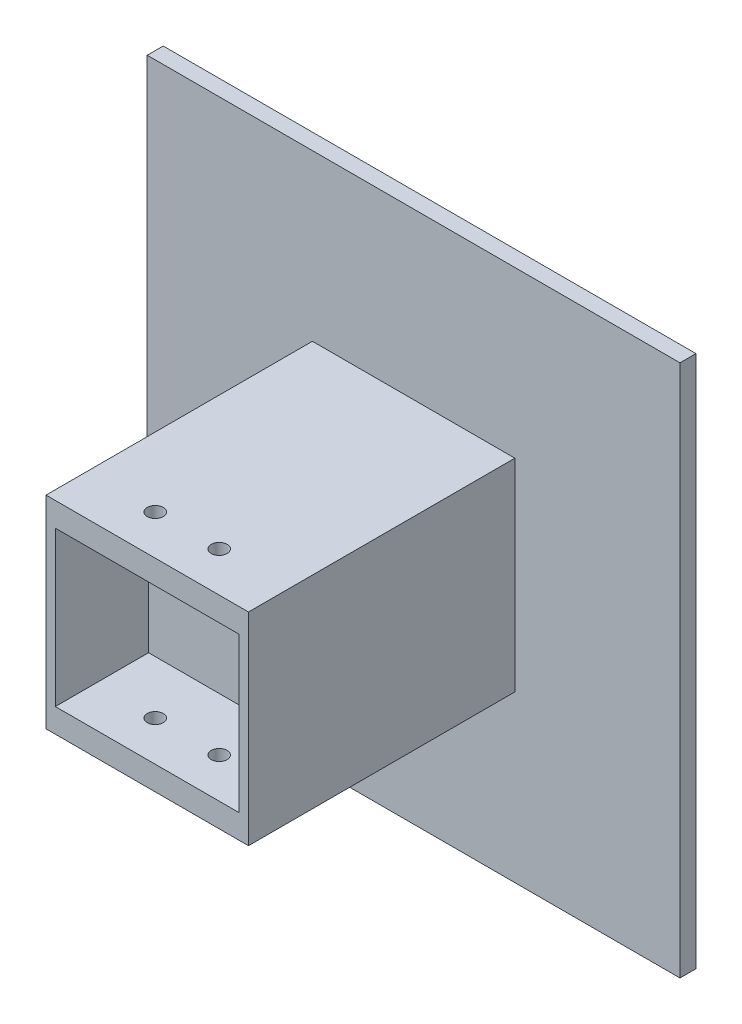
ISO-10303-21;
HEADER;
FILE_DESCRIPTION(('STEP AP214'),'2;1');
FILE_NAME('part.step','',(''),(''),'','','');
FILE_SCHEMA(('AUTOMOTIVE_DESIGN { 1 0 10303 214 1 1 1 1 }'));
ENDSEC;
DATA;
#1=APPLICATION_CONTEXT('core data for automotive mechanical design processes');
#2=APPLICATION_PROTOCOL_DEFINITION('international standard','automotive_design',2000,#1);
#3=PRODUCT_CONTEXT('',#1,'mechanical');
#4=PRODUCT('Part','Part','',(#3));
#5=PRODUCT_RELATED_PRODUCT_CATEGORY('part','',(#4));
#6=PRODUCT_DEFINITION_FORMATION('','',#4);
#7=PRODUCT_DEFINITION_CONTEXT('part definition',#1,'design');
#8=PRODUCT_DEFINITION('design','',#6,#7);
#9=PRODUCT_DEFINITION_SHAPE('','',#8);
#10=(LENGTH_UNIT() NAMED_UNIT(*) SI_UNIT(.MILLI.,.METRE.));
#11=(NAMED_UNIT(*) PLANE_ANGLE_UNIT() SI_UNIT($,.RADIAN.));
#12=(NAMED_UNIT(*) SI_UNIT($,.STERADIAN.) SOLID_ANGLE_UNIT());
#13=UNCERTAINTY_MEASURE_WITH_UNIT(LENGTH_MEASURE(1.E-05),#10,'distance_accuracy_value','');
#14=(GEOMETRIC_REPRESENTATION_CONTEXT(3) GLOBAL_UNCERTAINTY_ASSIGNED_CONTEXT((#13)) GLOBAL_UNIT_ASSIGNED_CONTEXT((#10,
#11,#12)) REPRESENTATION_CONTEXT('',''));
#15=CARTESIAN_POINT('',(0.,0.,0.));
#16=DIRECTION('',(0.,0.,1.));
#17=DIRECTION('',(1.,0.,0.));
#18=AXIS2_PLACEMENT_3D('',#15,#16,#17);
#19=CARTESIAN_POINT('',(-19.,19.,53.));
#20=DIRECTION('',(0.,-1.,0.));
#21=DIRECTION('',(0.,0.,-1.));
#22=AXIS2_PLACEMENT_3D('',#19,#20,#21);
#23=PLANE('',#22);
#24=CARTESIAN_POINT('',(6.,19.,45.5));
#25=DIRECTION('',(0.,1.,0.));
#26=DIRECTION('',(0.,0.,1.));
#27=AXIS2_PLACEMENT_3D('',#24,#25,#26);
#28=CIRCLE('',#27,1.5);
#29=CARTESIAN_POINT('',(6.,19.,47.));
#30=VERTEX_POINT('',#29);
#31=EDGE_CURVE('E234',#30,#30,#28,.T.);
#32=ORIENTED_EDGE('',*,*,#31,.F.);
#33=EDGE_LOOP('',(#32));
#34=FACE_BOUND('',#33,.T.);
#35=DIRECTION('',(-1.,0.,0.));
#36=VECTOR('',#35,1.);
#37=CARTESIAN_POINT('',(-19.,19.,3.));
#38=LINE('',#37,#36);
#39=CARTESIAN_POINT('',(19.,19.,3.));
#40=VERTEX_POINT('',#39);
#41=CARTESIAN_POINT('',(-19.,19.,3.));
#42=VERTEX_POINT('',#41);
#43=EDGE_CURVE('E181',#40,#42,#38,.T.);
#44=ORIENTED_EDGE('',*,*,#43,.T.);
#45=DIRECTION('',(0.,0.,-1.));
#46=VECTOR('',#45,1.);
#47=CARTESIAN_POINT('',(-19.,19.,53.));
#48=LINE('',#47,#46);
#49=CARTESIAN_POINT('',(-19.,19.,53.));
#50=VERTEX_POINT('',#49);
#51=EDGE_CURVE('E193',#50,#42,#48,.T.);
#52=ORIENTED_EDGE('',*,*,#51,.F.);
#53=DIRECTION('',(-1.,0.,0.));
#54=VECTOR('',#53,1.);
#55=CARTESIAN_POINT('',(-19.,19.,53.));
#56=LINE('',#55,#54);
#57=CARTESIAN_POINT('',(19.,19.,53.));
#58=VERTEX_POINT('',#57);
#59=EDGE_CURVE('E172',#58,#50,#56,.T.);
#60=ORIENTED_EDGE('',*,*,#59,.F.);
#61=DIRECTION('',(0.,0.,-1.));
#62=VECTOR('',#61,1.);
#63=CARTESIAN_POINT('',(19.,19.,53.));
#64=LINE('',#63,#62);
#65=EDGE_CURVE('E196',#58,#40,#64,.T.);
#66=ORIENTED_EDGE('',*,*,#65,.T.);
#67=EDGE_LOOP('',(#44,#52,#60,#66));
#68=FACE_BOUND('',#67,.T.);
#69=CARTESIAN_POINT('',(-6.,19.,45.5));
#70=DIRECTION('',(0.,-1.,0.));
#71=DIRECTION('',(0.,0.,-1.));
#72=AXIS2_PLACEMENT_3D('',#69,#70,#71);
#73=CIRCLE('',#72,1.5);
#74=CARTESIAN_POINT('',(-6.,19.,44.));
#75=VERTEX_POINT('',#74);
#76=EDGE_CURVE('E227',#75,#75,#73,.T.);
#77=ORIENTED_EDGE('',*,*,#76,.T.);
#78=EDGE_LOOP('',(#77));
#79=FACE_BOUND('',#78,.T.);
#80=ADVANCED_FACE('F36',(#34,#68,#79),#23,.F.);
#81=CARTESIAN_POINT('',(-19.,-19.,53.));
#82=DIRECTION('',(0.,1.,0.));
#83=DIRECTION('',(0.,0.,1.));
#84=AXIS2_PLACEMENT_3D('',#81,#82,#83);
#85=PLANE('',#84);
#86=CARTESIAN_POINT('',(6.,-19.,45.5));
#87=DIRECTION('',(0.,1.,0.));
#88=DIRECTION('',(0.,0.,1.));
#89=AXIS2_PLACEMENT_3D('',#86,#87,#88);
#90=CIRCLE('',#89,1.5);
#91=CARTESIAN_POINT('',(6.,-19.,47.));
#92=VERTEX_POINT('',#91);
#93=EDGE_CURVE('E231',#92,#92,#90,.T.);
#94=ORIENTED_EDGE('',*,*,#93,.T.);
#95=EDGE_LOOP('',(#94));
#96=FACE_BOUND('',#95,.T.);
#97=DIRECTION('',(1.,0.,0.));
#98=VECTOR('',#97,1.);
#99=CARTESIAN_POINT('',(-19.,-19.,3.));
#100=LINE('',#99,#98);
#101=CARTESIAN_POINT('',(-19.,-19.,3.));
#102=VERTEX_POINT('',#101);
#103=CARTESIAN_POINT('',(19.,-19.,3.));
#104=VERTEX_POINT('',#103);
#105=EDGE_CURVE('E173',#102,#104,#100,.T.);
#106=ORIENTED_EDGE('',*,*,#105,.T.);
#107=DIRECTION('',(0.,0.,-1.));
#108=VECTOR('',#107,1.);
#109=CARTESIAN_POINT('',(19.,-19.,53.));
#110=LINE('',#109,#108);
#111=CARTESIAN_POINT('',(19.,-19.,53.));
#112=VERTEX_POINT('',#111);
#113=EDGE_CURVE('E179',#112,#104,#110,.T.);
#114=ORIENTED_EDGE('',*,*,#113,.F.);
#115=DIRECTION('',(1.,0.,0.));
#116=VECTOR('',#115,1.);
#117=CARTESIAN_POINT('',(-19.,-19.,53.));
#118=LINE('',#117,#116);
#119=CARTESIAN_POINT('',(-19.,-19.,53.));
#120=VERTEX_POINT('',#119);
#121=EDGE_CURVE('E177',#120,#112,#118,.T.);
#122=ORIENTED_EDGE('',*,*,#121,.F.);
#123=DIRECTION('',(0.,0.,-1.));
#124=VECTOR('',#123,1.);
#125=CARTESIAN_POINT('',(-19.,-19.,53.));
#126=LINE('',#125,#124);
#127=EDGE_CURVE('E190',#120,#102,#126,.T.);
#128=ORIENTED_EDGE('',*,*,#127,.T.);
#129=EDGE_LOOP('',(#106,#114,#122,#128));
#130=FACE_BOUND('',#129,.T.);
#131=CARTESIAN_POINT('',(-6.,-19.,45.5));
#132=DIRECTION('',(0.,1.,0.));
#133=DIRECTION('',(0.,0.,1.));
#134=AXIS2_PLACEMENT_3D('',#131,#132,#133);
#135=CIRCLE('',#134,1.5);
#136=CARTESIAN_POINT('',(-6.,-19.,47.));
#137=VERTEX_POINT('',#136);
#138=EDGE_CURVE('E154',#137,#137,#135,.F.);
#139=ORIENTED_EDGE('',*,*,#138,.F.);
#140=EDGE_LOOP('',(#139));
#141=FACE_BOUND('',#140,.T.);
#142=ADVANCED_FACE('F260',(#96,#130,#141),#85,.F.);
#143=CARTESIAN_POINT('',(-17.25,-14.5,35.5));
#144=DIRECTION('',(0.,-1.,0.));
#145=DIRECTION('',(0.,0.,-1.));
#146=AXIS2_PLACEMENT_3D('',#143,#144,#145);
#147=PLANE('',#146);
#148=CARTESIAN_POINT('',(6.,-14.5,45.5));
#149=DIRECTION('',(0.,-1.,0.));
#150=DIRECTION('',(0.,0.,-1.));
#151=AXIS2_PLACEMENT_3D('',#148,#149,#150);
#152=CIRCLE('',#151,1.5);
#153=CARTESIAN_POINT('',(6.,-14.5,44.));
#154=VERTEX_POINT('',#153);
#155=EDGE_CURVE('E226',#154,#154,#152,.T.);
#156=ORIENTED_EDGE('',*,*,#155,.T.);
#157=EDGE_LOOP('',(#156));
#158=FACE_BOUND('',#157,.T.);
#159=DIRECTION('',(1.,0.,0.));
#160=VECTOR('',#159,1.);
#161=CARTESIAN_POINT('',(-17.25,-14.5,53.));
#162=LINE('',#161,#160);
#163=CARTESIAN_POINT('',(-17.25,-14.5,53.));
#164=VERTEX_POINT('',#163);
#165=CARTESIAN_POINT('',(17.25,-14.5,53.));
#166=VERTEX_POINT('',#165);
#167=EDGE_CURVE('E148',#164,#166,#162,.T.);
#168=ORIENTED_EDGE('',*,*,#167,.T.);
#169=DIRECTION('',(0.,0.,1.));
#170=VECTOR('',#169,1.);
#171=CARTESIAN_POINT('',(17.25,-14.5,35.5));
#172=LINE('',#171,#170);
#173=CARTESIAN_POINT('',(17.25,-14.5,35.5));
#174=VERTEX_POINT('',#173);
#175=EDGE_CURVE('E164',#174,#166,#172,.T.);
#176=ORIENTED_EDGE('',*,*,#175,.F.);
#177=DIRECTION('',(1.,0.,0.));
#178=VECTOR('',#177,1.);
#179=CARTESIAN_POINT('',(-17.25,-14.5,35.5));
#180=LINE('',#179,#178);
#181=CARTESIAN_POINT('',(-17.25,-14.5,35.5));
#182=VERTEX_POINT('',#181);
#183=EDGE_CURVE('E135',#182,#174,#180,.T.);
#184=ORIENTED_EDGE('',*,*,#183,.F.);
#185=DIRECTION('',(0.,0.,1.));
#186=VECTOR('',#185,1.);
#187=CARTESIAN_POINT('',(-17.25,-14.5,35.5));
#188=LINE('',#187,#186);
#189=EDGE_CURVE('E166',#182,#164,#188,.T.);
#190=ORIENTED_EDGE('',*,*,#189,.T.);
#191=EDGE_LOOP('',(#168,#176,#184,#190));
#192=FACE_BOUND('',#191,.T.);
#193=CARTESIAN_POINT('',(-6.,-14.5,45.5));
#194=DIRECTION('',(0.,-1.,0.));
#195=DIRECTION('',(0.,0.,-1.));
#196=AXIS2_PLACEMENT_3D('',#193,#194,#195);
#197=CIRCLE('',#196,1.5);
#198=CARTESIAN_POINT('',(-6.,-14.5,44.));
#199=VERTEX_POINT('',#198);
#200=EDGE_CURVE('E242',#199,#199,#197,.F.);
#201=ORIENTED_EDGE('',*,*,#200,.F.);
#202=EDGE_LOOP('',(#201));
#203=FACE_BOUND('',#202,.T.);
#204=ADVANCED_FACE('F252',(#158,#192,#203),#147,.F.);
#205=CARTESIAN_POINT('',(-17.25,14.5,35.5));
#206=DIRECTION('',(0.,1.,0.));
#207=DIRECTION('',(0.,0.,1.));
#208=AXIS2_PLACEMENT_3D('',#205,#206,#207);
#209=PLANE('',#208);
#210=CARTESIAN_POINT('',(6.,14.5,45.5));
#211=DIRECTION('',(0.,1.,0.));
#212=DIRECTION('',(0.,0.,1.));
#213=AXIS2_PLACEMENT_3D('',#210,#211,#212);
#214=CIRCLE('',#213,1.5);
#215=CARTESIAN_POINT('',(6.,14.5,47.));
#216=VERTEX_POINT('',#215);
#217=EDGE_CURVE('E224',#216,#216,#214,.T.);
#218=ORIENTED_EDGE('',*,*,#217,.T.);
#219=EDGE_LOOP('',(#218));
#220=FACE_BOUND('',#219,.T.);
#221=DIRECTION('',(-1.,0.,0.));
#222=VECTOR('',#221,1.);
#223=CARTESIAN_POINT('',(-17.25,14.5,53.));
#224=LINE('',#223,#222);
#225=CARTESIAN_POINT('',(17.25,14.5,53.));
#226=VERTEX_POINT('',#225);
#227=CARTESIAN_POINT('',(-17.25,14.5,53.));
#228=VERTEX_POINT('',#227);
#229=EDGE_CURVE('E160',#226,#228,#224,.T.);
#230=ORIENTED_EDGE('',*,*,#229,.T.);
#231=DIRECTION('',(0.,0.,1.));
#232=VECTOR('',#231,1.);
#233=CARTESIAN_POINT('',(-17.25,14.5,35.5));
#234=LINE('',#233,#232);
#235=CARTESIAN_POINT('',(-17.25,14.5,35.5));
#236=VERTEX_POINT('',#235);
#237=EDGE_CURVE('E134',#236,#228,#234,.T.);
#238=ORIENTED_EDGE('',*,*,#237,.F.);
#239=DIRECTION('',(-1.,0.,0.));
#240=VECTOR('',#239,1.);
#241=CARTESIAN_POINT('',(-17.25,14.5,35.5));
#242=LINE('',#241,#240);
#243=CARTESIAN_POINT('',(17.25,14.5,35.5));
#244=VERTEX_POINT('',#243);
#245=EDGE_CURVE('E138',#244,#236,#242,.T.);
#246=ORIENTED_EDGE('',*,*,#245,.F.);
#247=DIRECTION('',(0.,0.,1.));
#248=VECTOR('',#247,1.);
#249=CARTESIAN_POINT('',(17.25,14.5,35.5));
#250=LINE('',#249,#248);
#251=EDGE_CURVE('E125',#244,#226,#250,.T.);
#252=ORIENTED_EDGE('',*,*,#251,.T.);
#253=EDGE_LOOP('',(#230,#238,#246,#252));
#254=FACE_BOUND('',#253,.T.);
#255=CARTESIAN_POINT('',(-6.,14.5,45.5));
#256=DIRECTION('',(0.,1.,0.));
#257=DIRECTION('',(0.,0.,1.));
#258=AXIS2_PLACEMENT_3D('',#255,#256,#257);
#259=CIRCLE('',#258,1.5);
#260=CARTESIAN_POINT('',(-6.,14.5,47.));
#261=VERTEX_POINT('',#260);
#262=EDGE_CURVE('E40',#261,#261,#259,.F.);
#263=ORIENTED_EDGE('',*,*,#262,.F.);
#264=EDGE_LOOP('',(#263));
#265=FACE_BOUND('',#264,.T.);
#266=ADVANCED_FACE('F139',(#220,#254,#265),#209,.F.);
#267=CARTESIAN_POINT('',(50.,50.,3.));
#268=DIRECTION('',(-1.,0.,0.));
#269=DIRECTION('',(0.,0.,1.));
#270=AXIS2_PLACEMENT_3D('',#267,#268,#269);
#271=PLANE('',#270);
#272=DIRECTION('',(0.,1.,0.));
#273=VECTOR('',#272,1.);
#274=CARTESIAN_POINT('',(50.,50.,0.));
#275=LINE('',#274,#273);
#276=CARTESIAN_POINT('',(50.,-50.,0.));
#277=VERTEX_POINT('',#276);
#278=CARTESIAN_POINT('',(50.,50.,0.));
#279=VERTEX_POINT('',#278);
#280=EDGE_CURVE('E199',#277,#279,#275,.T.);
#281=ORIENTED_EDGE('',*,*,#280,.T.);
#282=DIRECTION('',(0.,0.,-1.));
#283=VECTOR('',#282,1.);
#284=CARTESIAN_POINT('',(50.,50.,3.));
#285=LINE('',#284,#283);
#286=CARTESIAN_POINT('',(50.,50.,3.));
#287=VERTEX_POINT('',#286);
#288=EDGE_CURVE('E11',#287,#279,#285,.T.);
#289=ORIENTED_EDGE('',*,*,#288,.F.);
#290=DIRECTION('',(0.,1.,0.));
#291=VECTOR('',#290,1.);
#292=CARTESIAN_POINT('',(50.,50.,3.));
#293=LINE('',#292,#291);
#294=CARTESIAN_POINT('',(50.,-50.,3.));
#295=VERTEX_POINT('',#294);
#296=EDGE_CURVE('E200',#295,#287,#293,.T.);
#297=ORIENTED_EDGE('',*,*,#296,.F.);
#298=DIRECTION('',(0.,0.,-1.));
#299=VECTOR('',#298,1.);
#300=CARTESIAN_POINT('',(50.,-50.,3.));
#301=LINE('',#300,#299);
#302=EDGE_CURVE('E210',#295,#277,#301,.T.);
#303=ORIENTED_EDGE('',*,*,#302,.T.);
#304=EDGE_LOOP('',(#281,#289,#297,#303));
#305=FACE_BOUND('',#304,.T.);
#306=ADVANCED_FACE('F38',(#305),#271,.F.);
#307=CARTESIAN_POINT('',(-50.,50.,3.));
#308=DIRECTION('',(0.,-1.,0.));
#309=DIRECTION('',(0.,0.,-1.));
#310=AXIS2_PLACEMENT_3D('',#307,#308,#309);
#311=PLANE('',#310);
#312=DIRECTION('',(-1.,0.,0.));
#313=VECTOR('',#312,1.);
#314=CARTESIAN_POINT('',(-50.,50.,0.));
#315=LINE('',#314,#313);
#316=CARTESIAN_POINT('',(-50.,50.,0.));
#317=VERTEX_POINT('',#316);
#318=EDGE_CURVE('E213',#279,#317,#315,.T.);
#319=ORIENTED_EDGE('',*,*,#318,.T.);
#320=DIRECTION('',(0.,0.,-1.));
#321=VECTOR('',#320,1.);
#322=CARTESIAN_POINT('',(-50.,50.,3.));
#323=LINE('',#322,#321);
#324=CARTESIAN_POINT('',(-50.,50.,3.));
#325=VERTEX_POINT('',#324);
#326=EDGE_CURVE('E45',#325,#317,#323,.T.);
#327=ORIENTED_EDGE('',*,*,#326,.F.);
#328=DIRECTION('',(-1.,0.,0.));
#329=VECTOR('',#328,1.);
#330=CARTESIAN_POINT('',(-50.,50.,3.));
#331=LINE('',#330,#329);
#332=EDGE_CURVE('E203',#287,#325,#331,.T.);
#333=ORIENTED_EDGE('',*,*,#332,.F.);
#334=ORIENTED_EDGE('',*,*,#288,.T.);
#335=EDGE_LOOP('',(#319,#327,#333,#334));
#336=FACE_BOUND('',#335,.T.);
#337=ADVANCED_FACE('F258',(#336),#311,.F.);
#338=CARTESIAN_POINT('',(-50.,50.,3.));
#339=DIRECTION('',(1.,0.,0.));
#340=DIRECTION('',(0.,0.,-1.));
#341=AXIS2_PLACEMENT_3D('',#338,#339,#340);
#342=PLANE('',#341);
#343=DIRECTION('',(0.,-1.,0.));
#344=VECTOR('',#343,1.);
#345=CARTESIAN_POINT('',(-50.,50.,0.));
#346=LINE('',#345,#344);
#347=CARTESIAN_POINT('',(-50.,-50.,0.));
#348=VERTEX_POINT('',#347);
#349=EDGE_CURVE('E215',#317,#348,#346,.T.);
#350=ORIENTED_EDGE('',*,*,#349,.T.);
#351=DIRECTION('',(0.,0.,-1.));
#352=VECTOR('',#351,1.);
#353=CARTESIAN_POINT('',(-50.,-50.,3.));
#354=LINE('',#353,#352);
#355=CARTESIAN_POINT('',(-50.,-50.,3.));
#356=VERTEX_POINT('',#355);
#357=EDGE_CURVE('E220',#356,#348,#354,.T.);
#358=ORIENTED_EDGE('',*,*,#357,.F.);
#359=DIRECTION('',(0.,-1.,0.));
#360=VECTOR('',#359,1.);
#361=CARTESIAN_POINT('',(-50.,50.,3.));
#362=LINE('',#361,#360);
#363=EDGE_CURVE('E206',#325,#356,#362,.T.);
#364=ORIENTED_EDGE('',*,*,#363,.F.);
#365=ORIENTED_EDGE('',*,*,#326,.T.);
#366=EDGE_LOOP('',(#350,#358,#364,#365));
#367=FACE_BOUND('',#366,.T.);
#368=ADVANCED_FACE('F292',(#367),#342,.F.);
#369=CARTESIAN_POINT('',(-50.,-50.,3.));
#370=DIRECTION('',(0.,1.,0.));
#371=DIRECTION('',(0.,0.,1.));
#372=AXIS2_PLACEMENT_3D('',#369,#370,#371);
#373=PLANE('',#372);
#374=DIRECTION('',(1.,0.,0.));
#375=VECTOR('',#374,1.);
#376=CARTESIAN_POINT('',(-50.,-50.,0.));
#377=LINE('',#376,#375);
#378=EDGE_CURVE('E204',#348,#277,#377,.T.);
#379=ORIENTED_EDGE('',*,*,#378,.T.);
#380=ORIENTED_EDGE('',*,*,#302,.F.);
#381=DIRECTION('',(1.,0.,0.));
#382=VECTOR('',#381,1.);
#383=CARTESIAN_POINT('',(-50.,-50.,3.));
#384=LINE('',#383,#382);
#385=EDGE_CURVE('E208',#356,#295,#384,.T.);
#386=ORIENTED_EDGE('',*,*,#385,.F.);
#387=ORIENTED_EDGE('',*,*,#357,.T.);
#388=EDGE_LOOP('',(#379,#380,#386,#387));
#389=FACE_BOUND('',#388,.T.);
#390=ADVANCED_FACE('F286',(#389),#373,.F.);
#391=CARTESIAN_POINT('',(0.,0.,3.));
#392=DIRECTION('',(0.,0.,1.));
#393=DIRECTION('',(1.,0.,0.));
#394=AXIS2_PLACEMENT_3D('',#391,#392,#393);
#395=PLANE('',#394);
#396=DIRECTION('',(0.,1.,0.));
#397=VECTOR('',#396,1.);
#398=CARTESIAN_POINT('',(19.,19.,3.));
#399=LINE('',#398,#397);
#400=EDGE_CURVE('E61',#104,#40,#399,.T.);
#401=ORIENTED_EDGE('',*,*,#400,.F.);
#402=ORIENTED_EDGE('',*,*,#105,.F.);
#403=DIRECTION('',(0.,-1.,0.));
#404=VECTOR('',#403,1.);
#405=CARTESIAN_POINT('',(-19.,19.,3.));
#406=LINE('',#405,#404);
#407=EDGE_CURVE('E184',#42,#102,#406,.T.);
#408=ORIENTED_EDGE('',*,*,#407,.F.);
#409=ORIENTED_EDGE('',*,*,#43,.F.);
#410=EDGE_LOOP('',(#401,#402,#408,#409));
#411=FACE_BOUND('',#410,.T.);
#412=ORIENTED_EDGE('',*,*,#296,.T.);
#413=ORIENTED_EDGE('',*,*,#332,.T.);
#414=ORIENTED_EDGE('',*,*,#363,.T.);
#415=ORIENTED_EDGE('',*,*,#385,.T.);
#416=EDGE_LOOP('',(#412,#413,#414,#415));
#417=FACE_BOUND('',#416,.T.);
#418=ADVANCED_FACE('F283',(#411,#417),#395,.T.);
#419=CARTESIAN_POINT('',(0.,0.,0.));
#420=DIRECTION('',(0.,0.,1.));
#421=DIRECTION('',(1.,0.,0.));
#422=AXIS2_PLACEMENT_3D('',#419,#420,#421);
#423=PLANE('',#422);
#424=ORIENTED_EDGE('',*,*,#280,.F.);
#425=ORIENTED_EDGE('',*,*,#378,.F.);
#426=ORIENTED_EDGE('',*,*,#349,.F.);
#427=ORIENTED_EDGE('',*,*,#318,.F.);
#428=EDGE_LOOP('',(#424,#425,#426,#427));
#429=FACE_BOUND('',#428,.T.);
#430=ADVANCED_FACE('F281',(#429),#423,.F.);
#431=CARTESIAN_POINT('',(19.,19.,53.));
#432=DIRECTION('',(-1.,0.,0.));
#433=DIRECTION('',(0.,0.,1.));
#434=AXIS2_PLACEMENT_3D('',#431,#432,#433);
#435=PLANE('',#434);
#436=ORIENTED_EDGE('',*,*,#400,.T.);
#437=ORIENTED_EDGE('',*,*,#65,.F.);
#438=DIRECTION('',(0.,1.,0.));
#439=VECTOR('',#438,1.);
#440=CARTESIAN_POINT('',(19.,19.,53.));
#441=LINE('',#440,#439);
#442=EDGE_CURVE('E169',#112,#58,#441,.T.);
#443=ORIENTED_EDGE('',*,*,#442,.F.);
#444=ORIENTED_EDGE('',*,*,#113,.T.);
#445=EDGE_LOOP('',(#436,#437,#443,#444));
#446=FACE_BOUND('',#445,.T.);
#447=ADVANCED_FACE('F278',(#446),#435,.F.);
#448=CARTESIAN_POINT('',(-19.,19.,53.));
#449=DIRECTION('',(1.,0.,0.));
#450=DIRECTION('',(0.,0.,-1.));
#451=AXIS2_PLACEMENT_3D('',#448,#449,#450);
#452=PLANE('',#451);
#453=ORIENTED_EDGE('',*,*,#407,.T.);
#454=ORIENTED_EDGE('',*,*,#127,.F.);
#455=DIRECTION('',(0.,-1.,0.));
#456=VECTOR('',#455,1.);
#457=CARTESIAN_POINT('',(-19.,19.,53.));
#458=LINE('',#457,#456);
#459=EDGE_CURVE('E175',#50,#120,#458,.T.);
#460=ORIENTED_EDGE('',*,*,#459,.F.);
#461=ORIENTED_EDGE('',*,*,#51,.T.);
#462=EDGE_LOOP('',(#453,#454,#460,#461));
#463=FACE_BOUND('',#462,.T.);
#464=ADVANCED_FACE('F277',(#463),#452,.F.);
#465=CARTESIAN_POINT('',(0.,0.,53.));
#466=DIRECTION('',(0.,0.,1.));
#467=DIRECTION('',(1.,0.,0.));
#468=AXIS2_PLACEMENT_3D('',#465,#466,#467);
#469=PLANE('',#468);
#470=DIRECTION('',(0.,1.,0.));
#471=VECTOR('',#470,1.);
#472=CARTESIAN_POINT('',(17.25,14.5,53.));
#473=LINE('',#472,#471);
#474=EDGE_CURVE('E53',#166,#226,#473,.T.);
#475=ORIENTED_EDGE('',*,*,#474,.F.);
#476=ORIENTED_EDGE('',*,*,#167,.F.);
#477=DIRECTION('',(0.,-1.,0.));
#478=VECTOR('',#477,1.);
#479=CARTESIAN_POINT('',(-17.25,14.5,53.));
#480=LINE('',#479,#478);
#481=EDGE_CURVE('E151',#228,#164,#480,.T.);
#482=ORIENTED_EDGE('',*,*,#481,.F.);
#483=ORIENTED_EDGE('',*,*,#229,.F.);
#484=EDGE_LOOP('',(#475,#476,#482,#483));
#485=FACE_BOUND('',#484,.T.);
#486=ORIENTED_EDGE('',*,*,#442,.T.);
#487=ORIENTED_EDGE('',*,*,#59,.T.);
#488=ORIENTED_EDGE('',*,*,#459,.T.);
#489=ORIENTED_EDGE('',*,*,#121,.T.);
#490=EDGE_LOOP('',(#486,#487,#488,#489));
#491=FACE_BOUND('',#490,.T.);
#492=ADVANCED_FACE('F339',(#485,#491),#469,.T.);
#493=CARTESIAN_POINT('',(17.25,14.5,35.5));
#494=DIRECTION('',(1.,0.,0.));
#495=DIRECTION('',(0.,0.,-1.));
#496=AXIS2_PLACEMENT_3D('',#493,#494,#495);
#497=PLANE('',#496);
#498=ORIENTED_EDGE('',*,*,#474,.T.);
#499=ORIENTED_EDGE('',*,*,#251,.F.);
#500=DIRECTION('',(0.,1.,0.));
#501=VECTOR('',#500,1.);
#502=CARTESIAN_POINT('',(17.25,14.5,35.5));
#503=LINE('',#502,#501);
#504=EDGE_CURVE('E129',#174,#244,#503,.T.);
#505=ORIENTED_EDGE('',*,*,#504,.F.);
#506=ORIENTED_EDGE('',*,*,#175,.T.);
#507=EDGE_LOOP('',(#498,#499,#505,#506));
#508=FACE_BOUND('',#507,.T.);
#509=ADVANCED_FACE('F127',(#508),#497,.F.);
#510=CARTESIAN_POINT('',(-17.25,14.5,35.5));
#511=DIRECTION('',(-1.,0.,0.));
#512=DIRECTION('',(0.,0.,1.));
#513=AXIS2_PLACEMENT_3D('',#510,#511,#512);
#514=PLANE('',#513);
#515=ORIENTED_EDGE('',*,*,#481,.T.);
#516=ORIENTED_EDGE('',*,*,#189,.F.);
#517=DIRECTION('',(0.,-1.,0.));
#518=VECTOR('',#517,1.);
#519=CARTESIAN_POINT('',(-17.25,14.5,35.5));
#520=LINE('',#519,#518);
#521=EDGE_CURVE('E144',#236,#182,#520,.T.);
#522=ORIENTED_EDGE('',*,*,#521,.F.);
#523=ORIENTED_EDGE('',*,*,#237,.T.);
#524=EDGE_LOOP('',(#515,#516,#522,#523));
#525=FACE_BOUND('',#524,.T.);
#526=ADVANCED_FACE('F353',(#525),#514,.F.);
#527=CARTESIAN_POINT('',(0.,0.,35.5));
#528=DIRECTION('',(0.,0.,1.));
#529=DIRECTION('',(1.,0.,0.));
#530=AXIS2_PLACEMENT_3D('',#527,#528,#529);
#531=PLANE('',#530);
#532=ORIENTED_EDGE('',*,*,#504,.T.);
#533=ORIENTED_EDGE('',*,*,#245,.T.);
#534=ORIENTED_EDGE('',*,*,#521,.T.);
#535=ORIENTED_EDGE('',*,*,#183,.T.);
#536=EDGE_LOOP('',(#532,#533,#534,#535));
#537=FACE_BOUND('',#536,.T.);
#538=ADVANCED_FACE('F146',(#537),#531,.T.);
#539=CARTESIAN_POINT('',(6.,-31.,45.5));
#540=DIRECTION('',(0.,1.,0.));
#541=DIRECTION('',(0.,0.,1.));
#542=AXIS2_PLACEMENT_3D('',#539,#540,#541);
#543=CYLINDRICAL_SURFACE('',#542,1.5);
#544=ORIENTED_EDGE('',*,*,#31,.T.);
#545=EDGE_LOOP('',(#544));
#546=FACE_BOUND('',#545,.T.);
#547=ORIENTED_EDGE('',*,*,#217,.F.);
#548=EDGE_LOOP('',(#547));
#549=FACE_BOUND('',#548,.T.);
#550=ADVANCED_FACE('F365',(#546,#549),#543,.F.);
#551=CARTESIAN_POINT('',(-6.,-31.,45.5));
#552=DIRECTION('',(0.,1.,0.));
#553=DIRECTION('',(0.,0.,1.));
#554=AXIS2_PLACEMENT_3D('',#551,#552,#553);
#555=CYLINDRICAL_SURFACE('',#554,1.5);
#556=ORIENTED_EDGE('',*,*,#76,.F.);
#557=EDGE_LOOP('',(#556));
#558=FACE_BOUND('',#557,.T.);
#559=ORIENTED_EDGE('',*,*,#262,.T.);
#560=EDGE_LOOP('',(#559));
#561=FACE_BOUND('',#560,.T.);
#562=ADVANCED_FACE('F250',(#558,#561),#555,.F.);
#563=ORIENTED_EDGE('',*,*,#155,.F.);
#564=EDGE_LOOP('',(#563));
#565=FACE_BOUND('',#564,.T.);
#566=ORIENTED_EDGE('',*,*,#93,.F.);
#567=EDGE_LOOP('',(#566));
#568=FACE_BOUND('',#567,.T.);
#569=ADVANCED_FACE('F374',(#565,#568),#543,.F.);
#570=ORIENTED_EDGE('',*,*,#200,.T.);
#571=EDGE_LOOP('',(#570));
#572=FACE_BOUND('',#571,.T.);
#573=ORIENTED_EDGE('',*,*,#138,.T.);
#574=EDGE_LOOP('',(#573));
#575=FACE_BOUND('',#574,.T.);
#576=ADVANCED_FACE('F382',(#572,#575),#555,.F.);
#577=CLOSED_SHELL('',(#80,#142,#204,#266,#306,#337,#368,#390,#418,#430,#447,#464,#492,#509,#526,
#538,#550,#562,#569,#576));
#578=MANIFOLD_SOLID_BREP('B2',#577);
#579=ADVANCED_BREP_SHAPE_REPRESENTATION('',(#18,#578),#14);
#580=SHAPE_DEFINITION_REPRESENTATION(#9,#579);
ENDSEC;
END-ISO-10303-21;
